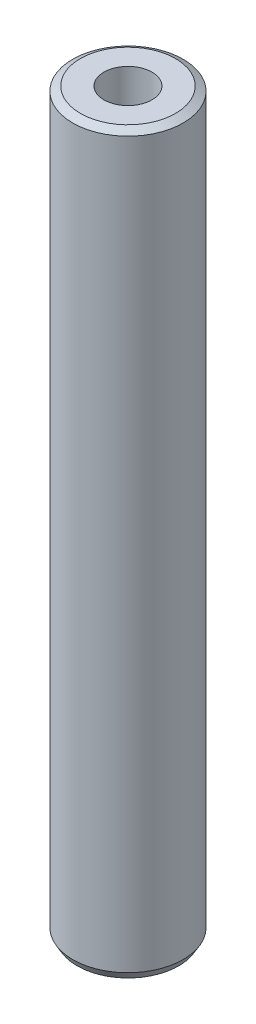
ISO-10303-21;
HEADER;
FILE_DESCRIPTION(('STEP AP214'),'2;1');
FILE_NAME('part.step','',(''),(''),'','','');
FILE_SCHEMA(('AUTOMOTIVE_DESIGN { 1 0 10303 214 1 1 1 1 }'));
ENDSEC;
DATA;
#1=APPLICATION_CONTEXT('core data for automotive mechanical design processes');
#2=APPLICATION_PROTOCOL_DEFINITION('international standard','automotive_design',2000,#1);
#3=PRODUCT_CONTEXT('',#1,'mechanical');
#4=PRODUCT('Part','Part','',(#3));
#5=PRODUCT_RELATED_PRODUCT_CATEGORY('part','',(#4));
#6=PRODUCT_DEFINITION_FORMATION('','',#4);
#7=PRODUCT_DEFINITION_CONTEXT('part definition',#1,'design');
#8=PRODUCT_DEFINITION('design','',#6,#7);
#9=PRODUCT_DEFINITION_SHAPE('','',#8);
#10=(LENGTH_UNIT() NAMED_UNIT(*) SI_UNIT(.MILLI.,.METRE.));
#11=(NAMED_UNIT(*) PLANE_ANGLE_UNIT() SI_UNIT($,.RADIAN.));
#12=(NAMED_UNIT(*) SI_UNIT($,.STERADIAN.) SOLID_ANGLE_UNIT());
#13=UNCERTAINTY_MEASURE_WITH_UNIT(LENGTH_MEASURE(1.E-05),#10,'distance_accuracy_value','');
#14=(GEOMETRIC_REPRESENTATION_CONTEXT(3) GLOBAL_UNCERTAINTY_ASSIGNED_CONTEXT((#13)) GLOBAL_UNIT_ASSIGNED_CONTEXT((#10,
#11,#12)) REPRESENTATION_CONTEXT('',''));
#15=CARTESIAN_POINT('',(0.,0.,0.));
#16=DIRECTION('',(0.,0.,1.));
#17=DIRECTION('',(1.,0.,0.));
#18=AXIS2_PLACEMENT_3D('',#15,#16,#17);
#19=CARTESIAN_POINT('',(0.,600.,0.));
#20=DIRECTION('',(0.,-1.,0.));
#21=DIRECTION('',(0.,0.,-1.));
#22=AXIS2_PLACEMENT_3D('',#19,#20,#21);
#23=CYLINDRICAL_SURFACE('',#22,45.);
#24=CARTESIAN_POINT('',(0.,596.384657821505,0.));
#25=DIRECTION('',(0.,1.,0.));
#26=DIRECTION('',(0.,0.,1.));
#27=AXIS2_PLACEMENT_3D('',#24,#25,#26);
#28=CIRCLE('',#27,45.);
#29=CARTESIAN_POINT('',(0.,596.384657821505,45.));
#30=VERTEX_POINT('',#29);
#31=EDGE_CURVE('E50',#30,#30,#28,.F.);
#32=ORIENTED_EDGE('',*,*,#31,.T.);
#33=EDGE_LOOP('',(#32));
#34=FACE_BOUND('',#33,.T.);
#35=CARTESIAN_POINT('',(0.,6.26195633989945,0.));
#36=DIRECTION('',(0.,1.,0.));
#37=DIRECTION('',(0.,0.,1.));
#38=AXIS2_PLACEMENT_3D('',#35,#36,#37);
#39=CIRCLE('',#38,45.);
#40=CARTESIAN_POINT('',(0.,6.26195633989945,45.));
#41=VERTEX_POINT('',#40);
#42=EDGE_CURVE('E51',#41,#41,#39,.T.);
#43=ORIENTED_EDGE('',*,*,#42,.T.);
#44=EDGE_LOOP('',(#43));
#45=FACE_BOUND('',#44,.T.);
#46=ADVANCED_FACE('F39',(#34,#45),#23,.T.);
#47=CARTESIAN_POINT('',(0.,600.,0.));
#48=DIRECTION('',(0.,1.,0.));
#49=DIRECTION('',(0.,0.,1.));
#50=AXIS2_PLACEMENT_3D('',#47,#48,#49);
#51=PLANE('',#50);
#52=CARTESIAN_POINT('',(0.,600.,0.));
#53=DIRECTION('',(0.,1.,0.));
#54=DIRECTION('',(0.,0.,1.));
#55=AXIS2_PLACEMENT_3D('',#52,#53,#54);
#56=CIRCLE('',#55,38.7380436601005);
#57=CARTESIAN_POINT('',(0.,600.,38.7380436601005));
#58=VERTEX_POINT('',#57);
#59=EDGE_CURVE('E54',#58,#58,#56,.T.);
#60=ORIENTED_EDGE('',*,*,#59,.T.);
#61=EDGE_LOOP('',(#60));
#62=FACE_BOUND('',#61,.T.);
#63=CARTESIAN_POINT('',(0.,600.,0.));
#64=DIRECTION('',(0.,1.,0.));
#65=DIRECTION('',(0.,0.,1.));
#66=AXIS2_PLACEMENT_3D('',#63,#64,#65);
#67=CIRCLE('',#66,19.588031255745);
#68=CARTESIAN_POINT('',(0.,600.,19.588031255745));
#69=VERTEX_POINT('',#68);
#70=EDGE_CURVE('E58',#69,#69,#67,.T.);
#71=ORIENTED_EDGE('',*,*,#70,.F.);
#72=EDGE_LOOP('',(#71));
#73=FACE_BOUND('',#72,.T.);
#74=ADVANCED_FACE('F69',(#62,#73),#51,.T.);
#75=CARTESIAN_POINT('',(0.,0.,0.));
#76=DIRECTION('',(0.,1.,0.));
#77=DIRECTION('',(0.,0.,1.));
#78=AXIS2_PLACEMENT_3D('',#75,#76,#77);
#79=PLANE('',#78);
#80=CARTESIAN_POINT('',(0.,0.,0.));
#81=DIRECTION('',(0.,1.,0.));
#82=DIRECTION('',(0.,0.,1.));
#83=AXIS2_PLACEMENT_3D('',#80,#81,#82);
#84=CIRCLE('',#83,41.3846578215053);
#85=CARTESIAN_POINT('',(0.,0.,41.3846578215053));
#86=VERTEX_POINT('',#85);
#87=EDGE_CURVE('E10',#86,#86,#84,.F.);
#88=ORIENTED_EDGE('',*,*,#87,.T.);
#89=EDGE_LOOP('',(#88));
#90=FACE_BOUND('',#89,.T.);
#91=CARTESIAN_POINT('',(0.,0.,0.));
#92=DIRECTION('',(0.,1.,0.));
#93=DIRECTION('',(0.,0.,1.));
#94=AXIS2_PLACEMENT_3D('',#91,#92,#93);
#95=CIRCLE('',#94,19.588031255745);
#96=CARTESIAN_POINT('',(0.,0.,19.588031255745));
#97=VERTEX_POINT('',#96);
#98=EDGE_CURVE('E63',#97,#97,#95,.T.);
#99=ORIENTED_EDGE('',*,*,#98,.T.);
#100=EDGE_LOOP('',(#99));
#101=FACE_BOUND('',#100,.T.);
#102=ADVANCED_FACE('F75',(#90,#101),#79,.F.);
#103=CARTESIAN_POINT('',(0.,600.,0.));
#104=DIRECTION('',(0.,-1.,0.));
#105=DIRECTION('',(0.,0.,-1.));
#106=AXIS2_PLACEMENT_3D('',#103,#104,#105);
#107=CYLINDRICAL_SURFACE('',#106,19.588031255745);
#108=ORIENTED_EDGE('',*,*,#70,.T.);
#109=EDGE_LOOP('',(#108));
#110=FACE_BOUND('',#109,.T.);
#111=ORIENTED_EDGE('',*,*,#98,.F.);
#112=EDGE_LOOP('',(#111));
#113=FACE_BOUND('',#112,.T.);
#114=ADVANCED_FACE('F70',(#110,#113),#107,.F.);
#115=CARTESIAN_POINT('',(0.,600.,0.));
#116=DIRECTION('',(0.,-1.,0.));
#117=DIRECTION('',(0.,0.,-1.));
#118=AXIS2_PLACEMENT_3D('',#115,#116,#117);
#119=CONICAL_SURFACE('',#118,38.7380436601005,1.0471975511966);
#120=ORIENTED_EDGE('',*,*,#31,.F.);
#121=EDGE_LOOP('',(#120));
#122=FACE_BOUND('',#121,.T.);
#123=ORIENTED_EDGE('',*,*,#59,.F.);
#124=EDGE_LOOP('',(#123));
#125=FACE_BOUND('',#124,.T.);
#126=ADVANCED_FACE('F81',(#122,#125),#119,.T.);
#127=CARTESIAN_POINT('',(0.,6.26195633989945,0.));
#128=DIRECTION('',(0.,1.,0.));
#129=DIRECTION('',(0.,0.,1.));
#130=AXIS2_PLACEMENT_3D('',#127,#128,#129);
#131=CONICAL_SURFACE('',#130,45.,0.523598775598307);
#132=ORIENTED_EDGE('',*,*,#87,.F.);
#133=EDGE_LOOP('',(#132));
#134=FACE_BOUND('',#133,.T.);
#135=ORIENTED_EDGE('',*,*,#42,.F.);
#136=EDGE_LOOP('',(#135));
#137=FACE_BOUND('',#136,.T.);
#138=ADVANCED_FACE('F45',(#134,#137),#131,.T.);
#139=CLOSED_SHELL('',(#46,#74,#102,#114,#126,#138));
#140=MANIFOLD_SOLID_BREP('B2',#139);
#141=ADVANCED_BREP_SHAPE_REPRESENTATION('',(#18,#140),#14);
#142=SHAPE_DEFINITION_REPRESENTATION(#9,#141);
ENDSEC;
END-ISO-10303-21;
